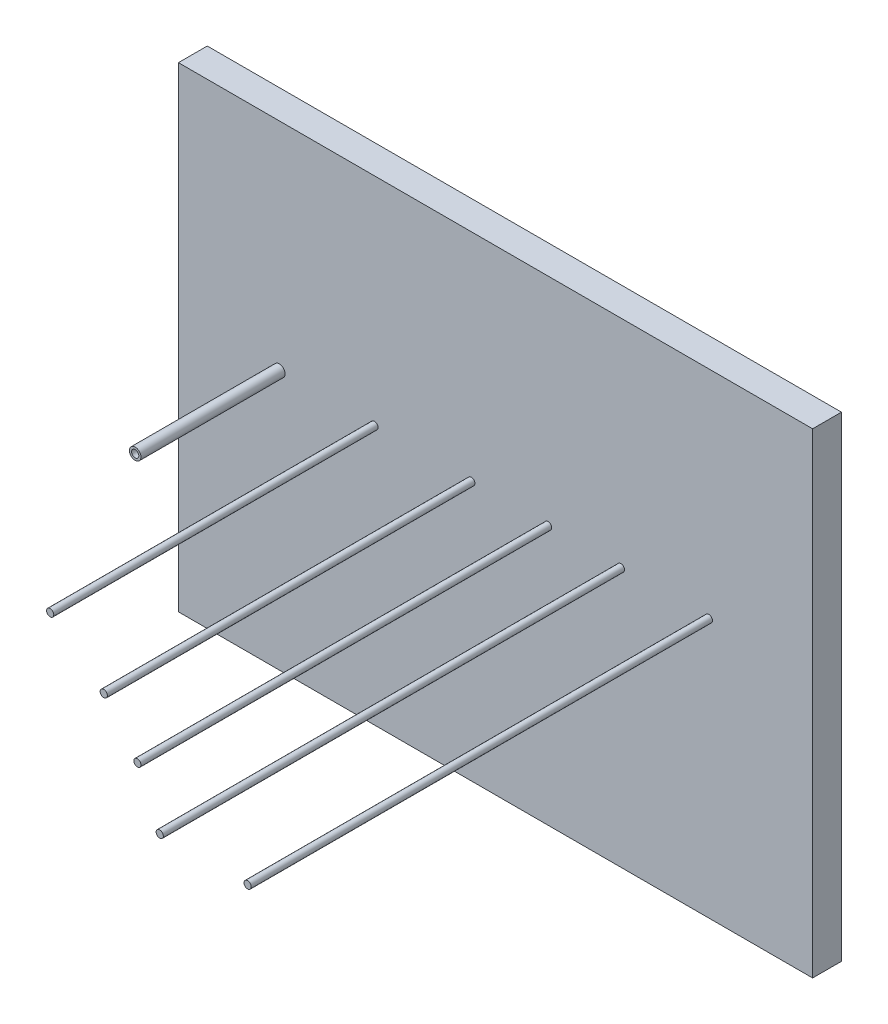
ISO-10303-21;
HEADER;
FILE_DESCRIPTION(('STEP AP214'),'2;1');
FILE_NAME('part.step','',(''),(''),'','','');
FILE_SCHEMA(('AUTOMOTIVE_DESIGN { 1 0 10303 214 1 1 1 1 }'));
ENDSEC;
DATA;
#1=APPLICATION_CONTEXT('core data for automotive mechanical design processes');
#2=APPLICATION_PROTOCOL_DEFINITION('international standard','automotive_design',2000,#1);
#3=PRODUCT_CONTEXT('',#1,'mechanical');
#4=PRODUCT('Part','Part','',(#3));
#5=PRODUCT_RELATED_PRODUCT_CATEGORY('part','',(#4));
#6=PRODUCT_DEFINITION_FORMATION('','',#4);
#7=PRODUCT_DEFINITION_CONTEXT('part definition',#1,'design');
#8=PRODUCT_DEFINITION('design','',#6,#7);
#9=PRODUCT_DEFINITION_SHAPE('','',#8);
#10=(LENGTH_UNIT() NAMED_UNIT(*) SI_UNIT(.MILLI.,.METRE.));
#11=(NAMED_UNIT(*) PLANE_ANGLE_UNIT() SI_UNIT($,.RADIAN.));
#12=(NAMED_UNIT(*) SI_UNIT($,.STERADIAN.) SOLID_ANGLE_UNIT());
#13=UNCERTAINTY_MEASURE_WITH_UNIT(LENGTH_MEASURE(1.E-05),#10,'distance_accuracy_value','');
#14=(GEOMETRIC_REPRESENTATION_CONTEXT(3) GLOBAL_UNCERTAINTY_ASSIGNED_CONTEXT((#13)) GLOBAL_UNIT_ASSIGNED_CONTEXT((#10,
#11,#12)) REPRESENTATION_CONTEXT('',''));
#15=CARTESIAN_POINT('',(0.,0.,0.));
#16=DIRECTION('',(0.,0.,1.));
#17=DIRECTION('',(1.,0.,0.));
#18=AXIS2_PLACEMENT_3D('',#15,#16,#17);
#19=CARTESIAN_POINT('',(0.,0.,20.));
#20=DIRECTION('',(1.,0.,0.));
#21=DIRECTION('',(0.,0.,-1.));
#22=AXIS2_PLACEMENT_3D('',#19,#20,#21);
#23=PLANE('',#22);
#24=DIRECTION('',(0.,-1.,0.));
#25=VECTOR('',#24,1.);
#26=CARTESIAN_POINT('',(0.,0.,0.));
#27=LINE('',#26,#25);
#28=CARTESIAN_POINT('',(0.,330.,0.));
#29=VERTEX_POINT('',#28);
#30=CARTESIAN_POINT('',(0.,0.,0.));
#31=VERTEX_POINT('',#30);
#32=EDGE_CURVE('E103',#29,#31,#27,.T.);
#33=ORIENTED_EDGE('',*,*,#32,.T.);
#34=DIRECTION('',(0.,0.,-1.));
#35=VECTOR('',#34,1.);
#36=CARTESIAN_POINT('',(0.,0.,20.));
#37=LINE('',#36,#35);
#38=CARTESIAN_POINT('',(0.,0.,20.));
#39=VERTEX_POINT('',#38);
#40=EDGE_CURVE('E94',#39,#31,#37,.T.);
#41=ORIENTED_EDGE('',*,*,#40,.F.);
#42=DIRECTION('',(0.,-1.,0.));
#43=VECTOR('',#42,1.);
#44=CARTESIAN_POINT('',(0.,0.,20.));
#45=LINE('',#44,#43);
#46=CARTESIAN_POINT('',(0.,330.,20.));
#47=VERTEX_POINT('',#46);
#48=EDGE_CURVE('E88',#47,#39,#45,.T.);
#49=ORIENTED_EDGE('',*,*,#48,.F.);
#50=DIRECTION('',(0.,0.,-1.));
#51=VECTOR('',#50,1.);
#52=CARTESIAN_POINT('',(0.,330.,20.));
#53=LINE('',#52,#51);
#54=EDGE_CURVE('E99',#47,#29,#53,.T.);
#55=ORIENTED_EDGE('',*,*,#54,.T.);
#56=EDGE_LOOP('',(#33,#41,#49,#55));
#57=FACE_BOUND('',#56,.T.);
#58=ADVANCED_FACE('F36',(#57),#23,.F.);
#59=CARTESIAN_POINT('',(0.,0.,20.));
#60=DIRECTION('',(0.,1.,0.));
#61=DIRECTION('',(0.,0.,1.));
#62=AXIS2_PLACEMENT_3D('',#59,#60,#61);
#63=PLANE('',#62);
#64=DIRECTION('',(1.,0.,0.));
#65=VECTOR('',#64,1.);
#66=CARTESIAN_POINT('',(0.,0.,0.));
#67=LINE('',#66,#65);
#68=CARTESIAN_POINT('',(440.,0.,0.));
#69=VERTEX_POINT('',#68);
#70=EDGE_CURVE('E93',#31,#69,#67,.T.);
#71=ORIENTED_EDGE('',*,*,#70,.T.);
#72=DIRECTION('',(0.,0.,-1.));
#73=VECTOR('',#72,1.);
#74=CARTESIAN_POINT('',(440.,0.,20.));
#75=LINE('',#74,#73);
#76=CARTESIAN_POINT('',(440.,0.,20.));
#77=VERTEX_POINT('',#76);
#78=EDGE_CURVE('E91',#77,#69,#75,.T.);
#79=ORIENTED_EDGE('',*,*,#78,.F.);
#80=DIRECTION('',(1.,0.,0.));
#81=VECTOR('',#80,1.);
#82=CARTESIAN_POINT('',(0.,0.,20.));
#83=LINE('',#82,#81);
#84=EDGE_CURVE('E83',#39,#77,#83,.T.);
#85=ORIENTED_EDGE('',*,*,#84,.F.);
#86=ORIENTED_EDGE('',*,*,#40,.T.);
#87=EDGE_LOOP('',(#71,#79,#85,#86));
#88=FACE_BOUND('',#87,.T.);
#89=ADVANCED_FACE('F92',(#88),#63,.F.);
#90=CARTESIAN_POINT('',(440.,0.,20.));
#91=DIRECTION('',(-1.,0.,0.));
#92=DIRECTION('',(0.,-1.,0.));
#93=AXIS2_PLACEMENT_3D('',#90,#91,#92);
#94=PLANE('',#93);
#95=DIRECTION('',(0.,1.,0.));
#96=VECTOR('',#95,1.);
#97=CARTESIAN_POINT('',(440.,0.,0.));
#98=LINE('',#97,#96);
#99=CARTESIAN_POINT('',(440.,330.,0.));
#100=VERTEX_POINT('',#99);
#101=EDGE_CURVE('E69',#69,#100,#98,.T.);
#102=ORIENTED_EDGE('',*,*,#101,.T.);
#103=DIRECTION('',(0.,0.,-1.));
#104=VECTOR('',#103,1.);
#105=CARTESIAN_POINT('',(440.,330.,20.));
#106=LINE('',#105,#104);
#107=CARTESIAN_POINT('',(440.,330.,20.));
#108=VERTEX_POINT('',#107);
#109=EDGE_CURVE('E95',#108,#100,#106,.T.);
#110=ORIENTED_EDGE('',*,*,#109,.F.);
#111=DIRECTION('',(0.,1.,0.));
#112=VECTOR('',#111,1.);
#113=CARTESIAN_POINT('',(440.,0.,20.));
#114=LINE('',#113,#112);
#115=EDGE_CURVE('E86',#77,#108,#114,.T.);
#116=ORIENTED_EDGE('',*,*,#115,.F.);
#117=ORIENTED_EDGE('',*,*,#78,.T.);
#118=EDGE_LOOP('',(#102,#110,#116,#117));
#119=FACE_BOUND('',#118,.T.);
#120=ADVANCED_FACE('F97',(#119),#94,.F.);
#121=CARTESIAN_POINT('',(0.,330.,20.));
#122=DIRECTION('',(0.,-1.,0.));
#123=DIRECTION('',(0.,0.,-1.));
#124=AXIS2_PLACEMENT_3D('',#121,#122,#123);
#125=PLANE('',#124);
#126=DIRECTION('',(-1.,0.,0.));
#127=VECTOR('',#126,1.);
#128=CARTESIAN_POINT('',(0.,330.,0.));
#129=LINE('',#128,#127);
#130=EDGE_CURVE('E75',#100,#29,#129,.T.);
#131=ORIENTED_EDGE('',*,*,#130,.T.);
#132=ORIENTED_EDGE('',*,*,#54,.F.);
#133=DIRECTION('',(-1.,0.,0.));
#134=VECTOR('',#133,1.);
#135=CARTESIAN_POINT('',(0.,330.,20.));
#136=LINE('',#135,#134);
#137=EDGE_CURVE('E52',#108,#47,#136,.T.);
#138=ORIENTED_EDGE('',*,*,#137,.F.);
#139=ORIENTED_EDGE('',*,*,#109,.T.);
#140=EDGE_LOOP('',(#131,#132,#138,#139));
#141=FACE_BOUND('',#140,.T.);
#142=ADVANCED_FACE('F132',(#141),#125,.F.);
#143=CARTESIAN_POINT('',(0.,0.,20.));
#144=DIRECTION('',(0.,0.,-1.));
#145=DIRECTION('',(-1.,0.,0.));
#146=AXIS2_PLACEMENT_3D('',#143,#144,#145);
#147=PLANE('',#146);
#148=CARTESIAN_POINT('',(368.,180.,20.));
#149=DIRECTION('',(0.,0.,-1.));
#150=DIRECTION('',(-1.,0.,0.));
#151=AXIS2_PLACEMENT_3D('',#148,#149,#150);
#152=CIRCLE('',#151,2.50000000000002);
#153=CARTESIAN_POINT('',(365.5,180.,20.));
#154=VERTEX_POINT('',#153);
#155=EDGE_CURVE('E11',#154,#154,#152,.F.);
#156=ORIENTED_EDGE('',*,*,#155,.F.);
#157=EDGE_LOOP('',(#156));
#158=FACE_BOUND('',#157,.T.);
#159=CARTESIAN_POINT('',(307.,180.,20.));
#160=DIRECTION('',(0.,0.,-1.));
#161=DIRECTION('',(-1.,0.,0.));
#162=AXIS2_PLACEMENT_3D('',#159,#160,#161);
#163=CIRCLE('',#162,2.50000000000002);
#164=CARTESIAN_POINT('',(304.5,180.,20.));
#165=VERTEX_POINT('',#164);
#166=EDGE_CURVE('E44',#165,#165,#163,.F.);
#167=ORIENTED_EDGE('',*,*,#166,.F.);
#168=EDGE_LOOP('',(#167));
#169=FACE_BOUND('',#168,.T.);
#170=CARTESIAN_POINT('',(256.5,180.,20.));
#171=DIRECTION('',(0.,0.,-1.));
#172=DIRECTION('',(-1.,0.,0.));
#173=AXIS2_PLACEMENT_3D('',#170,#171,#172);
#174=CIRCLE('',#173,2.50000000000002);
#175=CARTESIAN_POINT('',(254.,180.,20.));
#176=VERTEX_POINT('',#175);
#177=EDGE_CURVE('E122',#176,#176,#174,.F.);
#178=ORIENTED_EDGE('',*,*,#177,.F.);
#179=EDGE_LOOP('',(#178));
#180=FACE_BOUND('',#179,.T.);
#181=CARTESIAN_POINT('',(203.2,180.,20.));
#182=DIRECTION('',(0.,0.,-1.));
#183=DIRECTION('',(-1.,0.,0.));
#184=AXIS2_PLACEMENT_3D('',#181,#182,#183);
#185=CIRCLE('',#184,2.50000000000002);
#186=CARTESIAN_POINT('',(200.7,180.,20.));
#187=VERTEX_POINT('',#186);
#188=EDGE_CURVE('E119',#187,#187,#185,.F.);
#189=ORIENTED_EDGE('',*,*,#188,.F.);
#190=EDGE_LOOP('',(#189));
#191=FACE_BOUND('',#190,.T.);
#192=CARTESIAN_POINT('',(136.,180.,20.));
#193=DIRECTION('',(0.,0.,-1.));
#194=DIRECTION('',(-1.,0.,0.));
#195=AXIS2_PLACEMENT_3D('',#192,#193,#194);
#196=CIRCLE('',#195,2.5);
#197=CARTESIAN_POINT('',(133.5,180.,20.));
#198=VERTEX_POINT('',#197);
#199=EDGE_CURVE('E116',#198,#198,#196,.F.);
#200=ORIENTED_EDGE('',*,*,#199,.F.);
#201=EDGE_LOOP('',(#200));
#202=FACE_BOUND('',#201,.T.);
#203=CARTESIAN_POINT('',(70.,180.,20.));
#204=DIRECTION('',(0.,0.,-1.));
#205=DIRECTION('',(-1.,0.,0.));
#206=AXIS2_PLACEMENT_3D('',#203,#204,#205);
#207=CIRCLE('',#206,4.00000000000001);
#208=CARTESIAN_POINT('',(66.,180.,20.));
#209=VERTEX_POINT('',#208);
#210=EDGE_CURVE('E113',#209,#209,#207,.F.);
#211=ORIENTED_EDGE('',*,*,#210,.F.);
#212=EDGE_LOOP('',(#211));
#213=FACE_BOUND('',#212,.T.);
#214=ORIENTED_EDGE('',*,*,#48,.T.);
#215=ORIENTED_EDGE('',*,*,#84,.T.);
#216=ORIENTED_EDGE('',*,*,#115,.T.);
#217=ORIENTED_EDGE('',*,*,#137,.T.);
#218=EDGE_LOOP('',(#214,#215,#216,#217));
#219=FACE_BOUND('',#218,.T.);
#220=ADVANCED_FACE('F84',(#158,#169,#180,#191,#202,#213,#219),#147,.F.);
#221=CARTESIAN_POINT('',(0.,0.,0.));
#222=DIRECTION('',(0.,0.,-1.));
#223=DIRECTION('',(-1.,0.,0.));
#224=AXIS2_PLACEMENT_3D('',#221,#222,#223);
#225=PLANE('',#224);
#226=ORIENTED_EDGE('',*,*,#32,.F.);
#227=ORIENTED_EDGE('',*,*,#130,.F.);
#228=ORIENTED_EDGE('',*,*,#101,.F.);
#229=ORIENTED_EDGE('',*,*,#70,.F.);
#230=EDGE_LOOP('',(#226,#227,#228,#229));
#231=FACE_BOUND('',#230,.T.);
#232=ADVANCED_FACE('F131',(#231),#225,.T.);
#233=CARTESIAN_POINT('',(70.,180.,120.));
#234=DIRECTION('',(0.,0.,-1.));
#235=DIRECTION('',(-1.,0.,0.));
#236=AXIS2_PLACEMENT_3D('',#233,#234,#235);
#237=CYLINDRICAL_SURFACE('',#236,4.00000000000001);
#238=CARTESIAN_POINT('',(70.,180.,120.));
#239=DIRECTION('',(0.,0.,1.));
#240=DIRECTION('',(1.,0.,0.));
#241=AXIS2_PLACEMENT_3D('',#238,#239,#240);
#242=CIRCLE('',#241,4.00000000000001);
#243=CARTESIAN_POINT('',(74.,180.,120.));
#244=VERTEX_POINT('',#243);
#245=EDGE_CURVE('E106',#244,#244,#242,.T.);
#246=ORIENTED_EDGE('',*,*,#245,.F.);
#247=EDGE_LOOP('',(#246));
#248=FACE_BOUND('',#247,.T.);
#249=ORIENTED_EDGE('',*,*,#210,.T.);
#250=EDGE_LOOP('',(#249));
#251=FACE_BOUND('',#250,.T.);
#252=ADVANCED_FACE('F143',(#248,#251),#237,.T.);
#253=CARTESIAN_POINT('',(0.,0.,120.));
#254=DIRECTION('',(0.,0.,1.));
#255=DIRECTION('',(1.,0.,0.));
#256=AXIS2_PLACEMENT_3D('',#253,#254,#255);
#257=PLANE('',#256);
#258=CARTESIAN_POINT('',(70.,180.,120.));
#259=DIRECTION('',(0.,0.,1.));
#260=DIRECTION('',(1.,0.,0.));
#261=AXIS2_PLACEMENT_3D('',#258,#259,#260);
#262=CIRCLE('',#261,2.5);
#263=CARTESIAN_POINT('',(72.5,180.,120.));
#264=VERTEX_POINT('',#263);
#265=EDGE_CURVE('E345',#264,#264,#262,.T.);
#266=ORIENTED_EDGE('',*,*,#265,.F.);
#267=EDGE_LOOP('',(#266));
#268=FACE_BOUND('',#267,.T.);
#269=ORIENTED_EDGE('',*,*,#245,.T.);
#270=EDGE_LOOP('',(#269));
#271=FACE_BOUND('',#270,.T.);
#272=ADVANCED_FACE('F145',(#268,#271),#257,.T.);
#273=CARTESIAN_POINT('',(70.,180.,20.));
#274=DIRECTION('',(0.,0.,1.));
#275=DIRECTION('',(1.,0.,0.));
#276=AXIS2_PLACEMENT_3D('',#273,#274,#275);
#277=CYLINDRICAL_SURFACE('',#276,2.5);
#278=CARTESIAN_POINT('',(70.,180.,20.));
#279=DIRECTION('',(0.,0.,1.));
#280=DIRECTION('',(1.,0.,0.));
#281=AXIS2_PLACEMENT_3D('',#278,#279,#280);
#282=CIRCLE('',#281,2.5);
#283=CARTESIAN_POINT('',(72.5,180.,20.));
#284=VERTEX_POINT('',#283);
#285=EDGE_CURVE('E346',#284,#284,#282,.T.);
#286=ORIENTED_EDGE('',*,*,#285,.F.);
#287=EDGE_LOOP('',(#286));
#288=FACE_BOUND('',#287,.T.);
#289=ORIENTED_EDGE('',*,*,#265,.T.);
#290=EDGE_LOOP('',(#289));
#291=FACE_BOUND('',#290,.T.);
#292=ADVANCED_FACE('F152',(#288,#291),#277,.F.);
#293=CARTESIAN_POINT('',(70.,180.,20.));
#294=DIRECTION('',(0.,0.,1.));
#295=DIRECTION('',(1.,0.,0.));
#296=AXIS2_PLACEMENT_3D('',#293,#294,#295);
#297=PLANE('',#296);
#298=ORIENTED_EDGE('',*,*,#285,.T.);
#299=EDGE_LOOP('',(#298));
#300=FACE_BOUND('',#299,.T.);
#301=ADVANCED_FACE('F217',(#300),#297,.T.);
#302=CARTESIAN_POINT('',(136.,180.,245.));
#303=DIRECTION('',(0.,0.,-1.));
#304=DIRECTION('',(-1.,0.,0.));
#305=AXIS2_PLACEMENT_3D('',#302,#303,#304);
#306=CYLINDRICAL_SURFACE('',#305,2.5);
#307=CARTESIAN_POINT('',(136.,180.,245.));
#308=DIRECTION('',(0.,0.,1.));
#309=DIRECTION('',(1.,0.,0.));
#310=AXIS2_PLACEMENT_3D('',#307,#308,#309);
#311=CIRCLE('',#310,2.5);
#312=CARTESIAN_POINT('',(138.5,180.,245.));
#313=VERTEX_POINT('',#312);
#314=EDGE_CURVE('E342',#313,#313,#311,.T.);
#315=ORIENTED_EDGE('',*,*,#314,.F.);
#316=EDGE_LOOP('',(#315));
#317=FACE_BOUND('',#316,.T.);
#318=ORIENTED_EDGE('',*,*,#199,.T.);
#319=EDGE_LOOP('',(#318));
#320=FACE_BOUND('',#319,.T.);
#321=ADVANCED_FACE('F226',(#317,#320),#306,.T.);
#322=CARTESIAN_POINT('',(136.,180.,245.));
#323=DIRECTION('',(0.,0.,1.));
#324=DIRECTION('',(1.,0.,0.));
#325=AXIS2_PLACEMENT_3D('',#322,#323,#324);
#326=PLANE('',#325);
#327=ORIENTED_EDGE('',*,*,#314,.T.);
#328=EDGE_LOOP('',(#327));
#329=FACE_BOUND('',#328,.T.);
#330=ADVANCED_FACE('F235',(#329),#326,.T.);
#331=CARTESIAN_POINT('',(203.2,180.,275.));
#332=DIRECTION('',(0.,0.,-1.));
#333=DIRECTION('',(-1.,0.,0.));
#334=AXIS2_PLACEMENT_3D('',#331,#332,#333);
#335=CYLINDRICAL_SURFACE('',#334,2.50000000000002);
#336=CARTESIAN_POINT('',(203.2,180.,275.));
#337=DIRECTION('',(0.,0.,1.));
#338=DIRECTION('',(1.,0.,0.));
#339=AXIS2_PLACEMENT_3D('',#336,#337,#338);
#340=CIRCLE('',#339,2.50000000000002);
#341=CARTESIAN_POINT('',(205.7,180.,275.));
#342=VERTEX_POINT('',#341);
#343=EDGE_CURVE('E339',#342,#342,#340,.T.);
#344=ORIENTED_EDGE('',*,*,#343,.F.);
#345=EDGE_LOOP('',(#344));
#346=FACE_BOUND('',#345,.T.);
#347=ORIENTED_EDGE('',*,*,#188,.T.);
#348=EDGE_LOOP('',(#347));
#349=FACE_BOUND('',#348,.T.);
#350=ADVANCED_FACE('F244',(#346,#349),#335,.T.);
#351=CARTESIAN_POINT('',(203.2,180.,275.));
#352=DIRECTION('',(0.,0.,1.));
#353=DIRECTION('',(1.,0.,0.));
#354=AXIS2_PLACEMENT_3D('',#351,#352,#353);
#355=PLANE('',#354);
#356=ORIENTED_EDGE('',*,*,#343,.T.);
#357=EDGE_LOOP('',(#356));
#358=FACE_BOUND('',#357,.T.);
#359=ADVANCED_FACE('F253',(#358),#355,.T.);
#360=CARTESIAN_POINT('',(256.5,180.,305.));
#361=DIRECTION('',(0.,0.,-1.));
#362=DIRECTION('',(-1.,0.,0.));
#363=AXIS2_PLACEMENT_3D('',#360,#361,#362);
#364=CYLINDRICAL_SURFACE('',#363,2.50000000000002);
#365=CARTESIAN_POINT('',(256.5,180.,305.));
#366=DIRECTION('',(0.,0.,1.));
#367=DIRECTION('',(1.,0.,0.));
#368=AXIS2_PLACEMENT_3D('',#365,#366,#367);
#369=CIRCLE('',#368,2.50000000000002);
#370=CARTESIAN_POINT('',(259.,180.,305.));
#371=VERTEX_POINT('',#370);
#372=EDGE_CURVE('E334',#371,#371,#369,.T.);
#373=ORIENTED_EDGE('',*,*,#372,.F.);
#374=EDGE_LOOP('',(#373));
#375=FACE_BOUND('',#374,.T.);
#376=ORIENTED_EDGE('',*,*,#177,.T.);
#377=EDGE_LOOP('',(#376));
#378=FACE_BOUND('',#377,.T.);
#379=ADVANCED_FACE('F262',(#375,#378),#364,.T.);
#380=CARTESIAN_POINT('',(256.5,180.,305.));
#381=DIRECTION('',(0.,0.,1.));
#382=DIRECTION('',(1.,0.,0.));
#383=AXIS2_PLACEMENT_3D('',#380,#381,#382);
#384=PLANE('',#383);
#385=ORIENTED_EDGE('',*,*,#372,.T.);
#386=EDGE_LOOP('',(#385));
#387=FACE_BOUND('',#386,.T.);
#388=ADVANCED_FACE('F271',(#387),#384,.T.);
#389=CARTESIAN_POINT('',(307.,180.,340.));
#390=DIRECTION('',(0.,0.,-1.));
#391=DIRECTION('',(-1.,0.,0.));
#392=AXIS2_PLACEMENT_3D('',#389,#390,#391);
#393=CYLINDRICAL_SURFACE('',#392,2.50000000000002);
#394=CARTESIAN_POINT('',(307.,180.,340.));
#395=DIRECTION('',(0.,0.,1.));
#396=DIRECTION('',(1.,0.,0.));
#397=AXIS2_PLACEMENT_3D('',#394,#395,#396);
#398=CIRCLE('',#397,2.50000000000002);
#399=CARTESIAN_POINT('',(309.5,180.,340.));
#400=VERTEX_POINT('',#399);
#401=EDGE_CURVE('E331',#400,#400,#398,.T.);
#402=ORIENTED_EDGE('',*,*,#401,.F.);
#403=EDGE_LOOP('',(#402));
#404=FACE_BOUND('',#403,.T.);
#405=ORIENTED_EDGE('',*,*,#166,.T.);
#406=EDGE_LOOP('',(#405));
#407=FACE_BOUND('',#406,.T.);
#408=ADVANCED_FACE('F127',(#404,#407),#393,.T.);
#409=CARTESIAN_POINT('',(307.,180.,340.));
#410=DIRECTION('',(0.,0.,1.));
#411=DIRECTION('',(1.,0.,0.));
#412=AXIS2_PLACEMENT_3D('',#409,#410,#411);
#413=PLANE('',#412);
#414=ORIENTED_EDGE('',*,*,#401,.T.);
#415=EDGE_LOOP('',(#414));
#416=FACE_BOUND('',#415,.T.);
#417=ADVANCED_FACE('F286',(#416),#413,.T.);
#418=CARTESIAN_POINT('',(368.,180.,340.));
#419=DIRECTION('',(0.,0.,-1.));
#420=DIRECTION('',(-1.,0.,0.));
#421=AXIS2_PLACEMENT_3D('',#418,#419,#420);
#422=CYLINDRICAL_SURFACE('',#421,2.50000000000002);
#423=CARTESIAN_POINT('',(368.,180.,340.));
#424=DIRECTION('',(0.,0.,1.));
#425=DIRECTION('',(1.,0.,0.));
#426=AXIS2_PLACEMENT_3D('',#423,#424,#425);
#427=CIRCLE('',#426,2.50000000000002);
#428=CARTESIAN_POINT('',(370.5,180.,340.));
#429=VERTEX_POINT('',#428);
#430=EDGE_CURVE('E330',#429,#429,#427,.T.);
#431=ORIENTED_EDGE('',*,*,#430,.F.);
#432=EDGE_LOOP('',(#431));
#433=FACE_BOUND('',#432,.T.);
#434=ORIENTED_EDGE('',*,*,#155,.T.);
#435=EDGE_LOOP('',(#434));
#436=FACE_BOUND('',#435,.T.);
#437=ADVANCED_FACE('F295',(#433,#436),#422,.T.);
#438=CARTESIAN_POINT('',(368.,180.,340.));
#439=DIRECTION('',(0.,0.,1.));
#440=DIRECTION('',(1.,0.,0.));
#441=AXIS2_PLACEMENT_3D('',#438,#439,#440);
#442=PLANE('',#441);
#443=ORIENTED_EDGE('',*,*,#430,.T.);
#444=EDGE_LOOP('',(#443));
#445=FACE_BOUND('',#444,.T.);
#446=ADVANCED_FACE('F304',(#445),#442,.T.);
#447=CLOSED_SHELL('',(#58,#89,#120,#142,#220,#232,#252,#272,#292,#301,#321,#330,#350,#359,#379,
#388,#408,#417,#437,#446));
#448=MANIFOLD_SOLID_BREP('B2',#447);
#449=ADVANCED_BREP_SHAPE_REPRESENTATION('',(#18,#448),#14);
#450=SHAPE_DEFINITION_REPRESENTATION(#9,#449);
ENDSEC;
END-ISO-10303-21;
